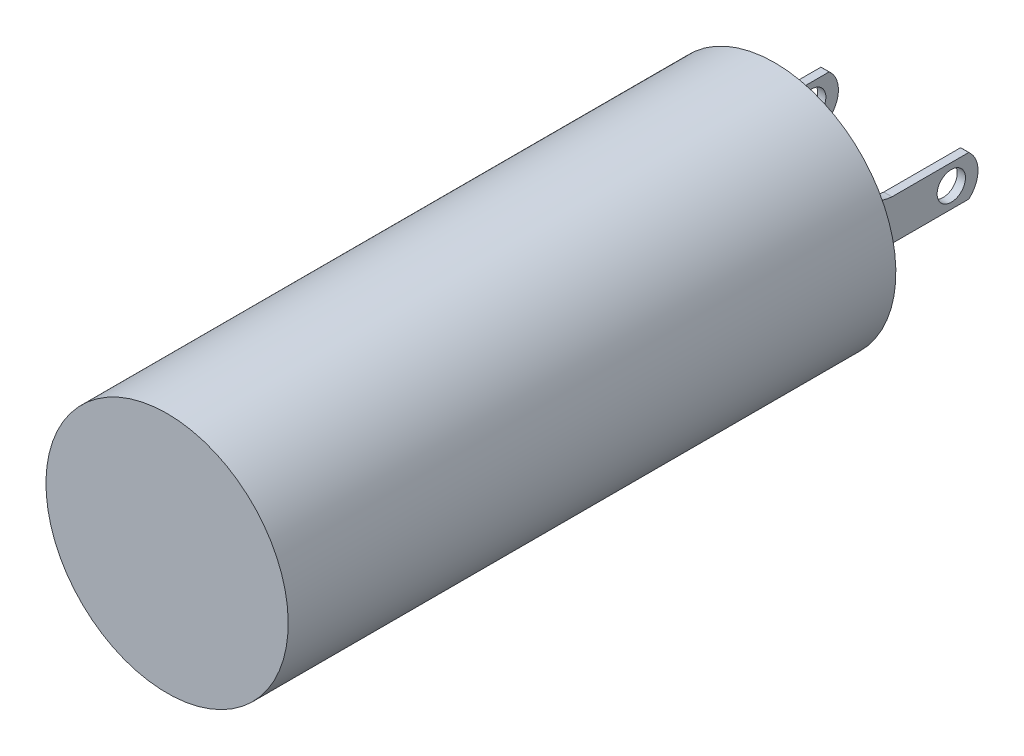
ISO-10303-21;
HEADER;
FILE_DESCRIPTION(('STEP AP214'),'2;1');
FILE_NAME('part.step','',(''),(''),'','','');
FILE_SCHEMA(('AUTOMOTIVE_DESIGN { 1 0 10303 214 1 1 1 1 }'));
ENDSEC;
DATA;
#1=APPLICATION_CONTEXT('core data for automotive mechanical design processes');
#2=APPLICATION_PROTOCOL_DEFINITION('international standard','automotive_design',2000,#1);
#3=PRODUCT_CONTEXT('',#1,'mechanical');
#4=PRODUCT('Part','Part','',(#3));
#5=PRODUCT_RELATED_PRODUCT_CATEGORY('part','',(#4));
#6=PRODUCT_DEFINITION_FORMATION('','',#4);
#7=PRODUCT_DEFINITION_CONTEXT('part definition',#1,'design');
#8=PRODUCT_DEFINITION('design','',#6,#7);
#9=PRODUCT_DEFINITION_SHAPE('','',#8);
#10=(LENGTH_UNIT() NAMED_UNIT(*) SI_UNIT(.MILLI.,.METRE.));
#11=(NAMED_UNIT(*) PLANE_ANGLE_UNIT() SI_UNIT($,.RADIAN.));
#12=(NAMED_UNIT(*) SI_UNIT($,.STERADIAN.) SOLID_ANGLE_UNIT());
#13=UNCERTAINTY_MEASURE_WITH_UNIT(LENGTH_MEASURE(1.E-05),#10,'distance_accuracy_value','');
#14=(GEOMETRIC_REPRESENTATION_CONTEXT(3) GLOBAL_UNCERTAINTY_ASSIGNED_CONTEXT((#13)) GLOBAL_UNIT_ASSIGNED_CONTEXT((#10,
#11,#12)) REPRESENTATION_CONTEXT('',''));
#15=CARTESIAN_POINT('',(0.,0.,0.));
#16=DIRECTION('',(0.,0.,1.));
#17=DIRECTION('',(1.,0.,0.));
#18=AXIS2_PLACEMENT_3D('',#15,#16,#17);
#19=CARTESIAN_POINT('',(0.,1.5875,-15.0368));
#20=DIRECTION('',(0.,0.,-1.));
#21=DIRECTION('',(0.,1.,0.));
#22=AXIS2_PLACEMENT_3D('',#19,#20,#21);
#23=PLANE('',#22);
#24=DIRECTION('',(0.,-1.,0.));
#25=VECTOR('',#24,1.);
#26=CARTESIAN_POINT('',(-1.8288,0.635,-15.0368));
#27=LINE('',#26,#25);
#28=CARTESIAN_POINT('',(-1.8288,0.635,-15.0368));
#29=VERTEX_POINT('',#28);
#30=CARTESIAN_POINT('',(-1.8288,-0.635,-15.0368));
#31=VERTEX_POINT('',#30);
#32=EDGE_CURVE('E168',#29,#31,#27,.T.);
#33=ORIENTED_EDGE('',*,*,#32,.T.);
#34=DIRECTION('',(1.,0.,0.));
#35=VECTOR('',#34,1.);
#36=CARTESIAN_POINT('',(-1.8288,-0.635,-15.0368));
#37=LINE('',#36,#35);
#38=CARTESIAN_POINT('',(-1.6256,-0.635,-15.0368));
#39=VERTEX_POINT('',#38);
#40=EDGE_CURVE('E213',#31,#39,#37,.T.);
#41=ORIENTED_EDGE('',*,*,#40,.T.);
#42=DIRECTION('',(0.,-1.,0.));
#43=VECTOR('',#42,1.);
#44=CARTESIAN_POINT('',(-1.6256,0.635,-15.0368));
#45=LINE('',#44,#43);
#46=CARTESIAN_POINT('',(-1.6256,0.635,-15.0368));
#47=VERTEX_POINT('',#46);
#48=EDGE_CURVE('E170',#47,#39,#45,.T.);
#49=ORIENTED_EDGE('',*,*,#48,.F.);
#50=DIRECTION('',(1.,0.,0.));
#51=VECTOR('',#50,1.);
#52=CARTESIAN_POINT('',(-1.8288,0.635,-15.0368));
#53=LINE('',#52,#51);
#54=EDGE_CURVE('E191',#29,#47,#53,.T.);
#55=ORIENTED_EDGE('',*,*,#54,.F.);
#56=EDGE_LOOP('',(#33,#41,#49,#55));
#57=FACE_BOUND('',#56,.T.);
#58=CARTESIAN_POINT('',(0.,0.,-15.0368));
#59=DIRECTION('',(0.,0.,-1.));
#60=DIRECTION('',(0.,1.,0.));
#61=AXIS2_PLACEMENT_3D('',#58,#59,#60);
#62=CIRCLE('',#61,1.5875);
#63=CARTESIAN_POINT('',(0.,1.5875,-15.0368));
#64=VERTEX_POINT('',#63);
#65=EDGE_CURVE('E289',#64,#64,#62,.T.);
#66=ORIENTED_EDGE('',*,*,#65,.F.);
#67=EDGE_LOOP('',(#66));
#68=FACE_BOUND('',#67,.T.);
#69=CARTESIAN_POINT('',(0.,0.,-15.0368));
#70=DIRECTION('',(0.,0.,-1.));
#71=DIRECTION('',(0.,1.,0.));
#72=AXIS2_PLACEMENT_3D('',#69,#70,#71);
#73=CIRCLE('',#72,2.9972);
#74=CARTESIAN_POINT('',(0.,2.9972,-15.0368));
#75=VERTEX_POINT('',#74);
#76=EDGE_CURVE('E44',#75,#75,#73,.T.);
#77=ORIENTED_EDGE('',*,*,#76,.T.);
#78=EDGE_LOOP('',(#77));
#79=FACE_BOUND('',#78,.T.);
#80=DIRECTION('',(0.,-1.,0.));
#81=VECTOR('',#80,1.);
#82=CARTESIAN_POINT('',(1.8288,0.635,-15.0368));
#83=LINE('',#82,#81);
#84=CARTESIAN_POINT('',(1.8288,0.635,-15.0368));
#85=VERTEX_POINT('',#84);
#86=CARTESIAN_POINT('',(1.8288,-0.635,-15.0368));
#87=VERTEX_POINT('',#86);
#88=EDGE_CURVE('E233',#85,#87,#83,.T.);
#89=ORIENTED_EDGE('',*,*,#88,.F.);
#90=DIRECTION('',(-1.,0.,0.));
#91=VECTOR('',#90,1.);
#92=CARTESIAN_POINT('',(1.8288,0.635,-15.0368));
#93=LINE('',#92,#91);
#94=CARTESIAN_POINT('',(1.6256,0.635,-15.0368));
#95=VERTEX_POINT('',#94);
#96=EDGE_CURVE('E283',#85,#95,#93,.T.);
#97=ORIENTED_EDGE('',*,*,#96,.T.);
#98=DIRECTION('',(0.,-1.,0.));
#99=VECTOR('',#98,1.);
#100=CARTESIAN_POINT('',(1.6256,0.635,-15.0368));
#101=LINE('',#100,#99);
#102=CARTESIAN_POINT('',(1.6256,-0.635,-15.0368));
#103=VERTEX_POINT('',#102);
#104=EDGE_CURVE('E250',#95,#103,#101,.T.);
#105=ORIENTED_EDGE('',*,*,#104,.T.);
#106=DIRECTION('',(-1.,0.,0.));
#107=VECTOR('',#106,1.);
#108=CARTESIAN_POINT('',(1.8288,-0.635,-15.0368));
#109=LINE('',#108,#107);
#110=EDGE_CURVE('E281',#87,#103,#109,.T.);
#111=ORIENTED_EDGE('',*,*,#110,.F.);
#112=EDGE_LOOP('',(#89,#97,#105,#111));
#113=FACE_BOUND('',#112,.T.);
#114=ADVANCED_FACE('F36',(#57,#68,#79,#113),#23,.T.);
#115=CARTESIAN_POINT('',(0.,0.,0.));
#116=DIRECTION('',(0.,0.,1.));
#117=DIRECTION('',(0.,-1.,0.));
#118=AXIS2_PLACEMENT_3D('',#115,#116,#117);
#119=PLANE('',#118);
#120=CARTESIAN_POINT('',(0.,0.,0.));
#121=DIRECTION('',(0.,0.,-1.));
#122=DIRECTION('',(0.,1.,0.));
#123=AXIS2_PLACEMENT_3D('',#120,#121,#122);
#124=CIRCLE('',#123,2.99719999999999);
#125=CARTESIAN_POINT('',(0.,2.99719999999999,0.));
#126=VERTEX_POINT('',#125);
#127=EDGE_CURVE('E11',#126,#126,#124,.T.);
#128=ORIENTED_EDGE('',*,*,#127,.F.);
#129=EDGE_LOOP('',(#128));
#130=FACE_BOUND('',#129,.T.);
#131=ADVANCED_FACE('F38',(#130),#119,.T.);
#132=CARTESIAN_POINT('',(0.,0.,-15.4178));
#133=DIRECTION('',(0.,0.,-1.));
#134=DIRECTION('',(0.,1.,0.));
#135=AXIS2_PLACEMENT_3D('',#132,#133,#134);
#136=CYLINDRICAL_SURFACE('',#135,2.99719999999999);
#137=ORIENTED_EDGE('',*,*,#127,.T.);
#138=EDGE_LOOP('',(#137));
#139=FACE_BOUND('',#138,.T.);
#140=ORIENTED_EDGE('',*,*,#76,.F.);
#141=EDGE_LOOP('',(#140));
#142=FACE_BOUND('',#141,.T.);
#143=ADVANCED_FACE('F296',(#139,#142),#136,.T.);
#144=CARTESIAN_POINT('',(0.,0.,-15.4178));
#145=DIRECTION('',(0.,0.,-1.));
#146=DIRECTION('',(0.,1.,0.));
#147=AXIS2_PLACEMENT_3D('',#144,#145,#146);
#148=CYLINDRICAL_SURFACE('',#147,1.5875);
#149=ORIENTED_EDGE('',*,*,#65,.T.);
#150=EDGE_LOOP('',(#149));
#151=FACE_BOUND('',#150,.T.);
#152=CARTESIAN_POINT('',(0.,0.,-15.4178));
#153=DIRECTION('',(0.,0.,-1.));
#154=DIRECTION('',(0.,1.,0.));
#155=AXIS2_PLACEMENT_3D('',#152,#153,#154);
#156=CIRCLE('',#155,1.5875);
#157=CARTESIAN_POINT('',(0.,1.5875,-15.4178));
#158=VERTEX_POINT('',#157);
#159=EDGE_CURVE('E286',#158,#158,#156,.T.);
#160=ORIENTED_EDGE('',*,*,#159,.F.);
#161=EDGE_LOOP('',(#160));
#162=FACE_BOUND('',#161,.T.);
#163=ADVANCED_FACE('F298',(#151,#162),#148,.T.);
#164=CARTESIAN_POINT('',(0.,0.,-15.4178));
#165=DIRECTION('',(0.,0.,-1.));
#166=DIRECTION('',(0.,1.,0.));
#167=AXIS2_PLACEMENT_3D('',#164,#165,#166);
#168=PLANE('',#167);
#169=ORIENTED_EDGE('',*,*,#159,.T.);
#170=EDGE_LOOP('',(#169));
#171=FACE_BOUND('',#170,.T.);
#172=ADVANCED_FACE('F304',(#171),#168,.T.);
#173=CARTESIAN_POINT('',(1.8288,1.54943210528019,-16.1927589575761));
#174=DIRECTION('',(1.,0.,0.));
#175=DIRECTION('',(0.,0.,-1.));
#176=AXIS2_PLACEMENT_3D('',#173,#174,#175);
#177=PLANE('',#176);
#178=DIRECTION('',(0.,0.,1.));
#179=VECTOR('',#178,1.);
#180=CARTESIAN_POINT('',(1.8288,0.635,-15.0368));
#181=LINE('',#180,#179);
#182=CARTESIAN_POINT('',(1.8288,0.635,-15.6718));
#183=VERTEX_POINT('',#182);
#184=EDGE_CURVE('E231',#183,#85,#181,.T.);
#185=ORIENTED_EDGE('',*,*,#184,.T.);
#186=ORIENTED_EDGE('',*,*,#88,.T.);
#187=DIRECTION('',(0.,0.,-1.));
#188=VECTOR('',#187,1.);
#189=CARTESIAN_POINT('',(1.8288,-0.635,-15.0368));
#190=LINE('',#189,#188);
#191=CARTESIAN_POINT('',(1.8288,-0.635,-15.6718));
#192=VERTEX_POINT('',#191);
#193=EDGE_CURVE('E59',#87,#192,#190,.T.);
#194=ORIENTED_EDGE('',*,*,#193,.T.);
#195=CARTESIAN_POINT('',(1.8288,-1.54943210528019,-16.1927589575761));
#196=DIRECTION('',(-1.,0.,0.));
#197=DIRECTION('',(0.,0.,1.));
#198=AXIS2_PLACEMENT_3D('',#195,#196,#197);
#199=CIRCLE('',#198,1.05241831542685);
#200=CARTESIAN_POINT('',(1.8288,-0.50038,-16.1086519361504));
#201=VERTEX_POINT('',#200);
#202=EDGE_CURVE('E237',#192,#201,#199,.T.);
#203=ORIENTED_EDGE('',*,*,#202,.T.);
#204=DIRECTION('',(0.,0.,-1.));
#205=VECTOR('',#204,1.);
#206=CARTESIAN_POINT('',(1.8288,-0.50038,-16.1086519361504));
#207=LINE('',#206,#205);
#208=CARTESIAN_POINT('',(1.8288,-0.50038,-18.0086));
#209=VERTEX_POINT('',#208);
#210=EDGE_CURVE('E239',#201,#209,#207,.T.);
#211=ORIENTED_EDGE('',*,*,#210,.T.);
#212=CARTESIAN_POINT('',(1.8288,0.,-17.5768));
#213=DIRECTION('',(1.,0.,0.));
#214=DIRECTION('',(0.,0.,1.));
#215=AXIS2_PLACEMENT_3D('',#212,#213,#214);
#216=CIRCLE('',#215,0.660932208626573);
#217=CARTESIAN_POINT('',(1.8288,0.50038,-18.0086));
#218=VERTEX_POINT('',#217);
#219=EDGE_CURVE('E241',#209,#218,#216,.T.);
#220=ORIENTED_EDGE('',*,*,#219,.T.);
#221=DIRECTION('',(0.,0.,1.));
#222=VECTOR('',#221,1.);
#223=CARTESIAN_POINT('',(1.8288,0.50038,-16.1086519361504));
#224=LINE('',#223,#222);
#225=CARTESIAN_POINT('',(1.8288,0.50038,-16.1086519361504));
#226=VERTEX_POINT('',#225);
#227=EDGE_CURVE('E243',#218,#226,#224,.T.);
#228=ORIENTED_EDGE('',*,*,#227,.T.);
#229=CARTESIAN_POINT('',(1.8288,1.54943210528019,-16.1927589575761));
#230=DIRECTION('',(-1.,0.,0.));
#231=DIRECTION('',(0.,0.,-1.));
#232=AXIS2_PLACEMENT_3D('',#229,#230,#231);
#233=CIRCLE('',#232,1.05241831542685);
#234=EDGE_CURVE('E245',#226,#183,#233,.T.);
#235=ORIENTED_EDGE('',*,*,#234,.T.);
#236=EDGE_LOOP('',(#185,#186,#194,#203,#211,#220,#228,#235));
#237=FACE_BOUND('',#236,.T.);
#238=CARTESIAN_POINT('',(1.8288,0.,-17.5768));
#239=DIRECTION('',(1.,0.,0.));
#240=DIRECTION('',(0.,0.,-1.));
#241=AXIS2_PLACEMENT_3D('',#238,#239,#240);
#242=CIRCLE('',#241,0.350520000000001);
#243=CARTESIAN_POINT('',(1.8288,0.,-17.92732));
#244=VERTEX_POINT('',#243);
#245=EDGE_CURVE('E225',#244,#244,#242,.T.);
#246=ORIENTED_EDGE('',*,*,#245,.F.);
#247=EDGE_LOOP('',(#246));
#248=FACE_BOUND('',#247,.T.);
#249=ADVANCED_FACE('F317',(#237,#248),#177,.T.);
#250=CARTESIAN_POINT('',(1.6256,1.54943210528019,-16.1927589575761));
#251=DIRECTION('',(1.,0.,0.));
#252=DIRECTION('',(0.,0.,-1.));
#253=AXIS2_PLACEMENT_3D('',#250,#251,#252);
#254=PLANE('',#253);
#255=DIRECTION('',(0.,0.,1.));
#256=VECTOR('',#255,1.);
#257=CARTESIAN_POINT('',(1.6256,0.635,-15.0368));
#258=LINE('',#257,#256);
#259=CARTESIAN_POINT('',(1.6256,0.635,-15.6718));
#260=VERTEX_POINT('',#259);
#261=EDGE_CURVE('E228',#260,#95,#258,.T.);
#262=ORIENTED_EDGE('',*,*,#261,.F.);
#263=CARTESIAN_POINT('',(1.6256,1.54943210528019,-16.1927589575761));
#264=DIRECTION('',(-1.,0.,0.));
#265=DIRECTION('',(0.,0.,-1.));
#266=AXIS2_PLACEMENT_3D('',#263,#264,#265);
#267=CIRCLE('',#266,1.05241831542685);
#268=CARTESIAN_POINT('',(1.6256,0.50038,-16.1086519361504));
#269=VERTEX_POINT('',#268);
#270=EDGE_CURVE('E234',#269,#260,#267,.T.);
#271=ORIENTED_EDGE('',*,*,#270,.F.);
#272=DIRECTION('',(0.,0.,1.));
#273=VECTOR('',#272,1.);
#274=CARTESIAN_POINT('',(1.6256,0.50038,-16.1086519361504));
#275=LINE('',#274,#273);
#276=CARTESIAN_POINT('',(1.6256,0.50038,-18.0086));
#277=VERTEX_POINT('',#276);
#278=EDGE_CURVE('E261',#277,#269,#275,.T.);
#279=ORIENTED_EDGE('',*,*,#278,.F.);
#280=CARTESIAN_POINT('',(1.6256,0.,-17.5768));
#281=DIRECTION('',(1.,0.,0.));
#282=DIRECTION('',(0.,0.,1.));
#283=AXIS2_PLACEMENT_3D('',#280,#281,#282);
#284=CIRCLE('',#283,0.660932208626573);
#285=CARTESIAN_POINT('',(1.6256,-0.50038,-18.0086));
#286=VERTEX_POINT('',#285);
#287=EDGE_CURVE('E259',#286,#277,#284,.T.);
#288=ORIENTED_EDGE('',*,*,#287,.F.);
#289=DIRECTION('',(0.,0.,-1.));
#290=VECTOR('',#289,1.);
#291=CARTESIAN_POINT('',(1.6256,-0.50038,-16.1086519361504));
#292=LINE('',#291,#290);
#293=CARTESIAN_POINT('',(1.6256,-0.50038,-16.1086519361504));
#294=VERTEX_POINT('',#293);
#295=EDGE_CURVE('E257',#294,#286,#292,.T.);
#296=ORIENTED_EDGE('',*,*,#295,.F.);
#297=CARTESIAN_POINT('',(1.6256,-1.54943210528019,-16.1927589575761));
#298=DIRECTION('',(-1.,0.,0.));
#299=DIRECTION('',(0.,0.,1.));
#300=AXIS2_PLACEMENT_3D('',#297,#298,#299);
#301=CIRCLE('',#300,1.05241831542685);
#302=CARTESIAN_POINT('',(1.6256,-0.635,-15.6718));
#303=VERTEX_POINT('',#302);
#304=EDGE_CURVE('E255',#303,#294,#301,.T.);
#305=ORIENTED_EDGE('',*,*,#304,.F.);
#306=DIRECTION('',(0.,0.,-1.));
#307=VECTOR('',#306,1.);
#308=CARTESIAN_POINT('',(1.6256,-0.635,-15.0368));
#309=LINE('',#308,#307);
#310=EDGE_CURVE('E253',#103,#303,#309,.T.);
#311=ORIENTED_EDGE('',*,*,#310,.F.);
#312=ORIENTED_EDGE('',*,*,#104,.F.);
#313=EDGE_LOOP('',(#262,#271,#279,#288,#296,#305,#311,#312));
#314=FACE_BOUND('',#313,.T.);
#315=CARTESIAN_POINT('',(1.6256,0.,-17.5768));
#316=DIRECTION('',(1.,0.,0.));
#317=DIRECTION('',(0.,0.,-1.));
#318=AXIS2_PLACEMENT_3D('',#315,#316,#317);
#319=CIRCLE('',#318,0.350520000000001);
#320=CARTESIAN_POINT('',(1.6256,0.,-17.92732));
#321=VERTEX_POINT('',#320);
#322=EDGE_CURVE('E157',#321,#321,#319,.T.);
#323=ORIENTED_EDGE('',*,*,#322,.T.);
#324=EDGE_LOOP('',(#323));
#325=FACE_BOUND('',#324,.T.);
#326=ADVANCED_FACE('F323',(#314,#325),#254,.F.);
#327=CARTESIAN_POINT('',(1.8288,0.635,-15.0368));
#328=DIRECTION('',(0.,-1.,0.));
#329=DIRECTION('',(0.,0.,-1.));
#330=AXIS2_PLACEMENT_3D('',#327,#328,#329);
#331=PLANE('',#330);
#332=ORIENTED_EDGE('',*,*,#261,.T.);
#333=ORIENTED_EDGE('',*,*,#96,.F.);
#334=ORIENTED_EDGE('',*,*,#184,.F.);
#335=DIRECTION('',(-1.,0.,0.));
#336=VECTOR('',#335,1.);
#337=CARTESIAN_POINT('',(1.8288,0.635,-15.6718));
#338=LINE('',#337,#336);
#339=EDGE_CURVE('E247',#183,#260,#338,.T.);
#340=ORIENTED_EDGE('',*,*,#339,.T.);
#341=EDGE_LOOP('',(#332,#333,#334,#340));
#342=FACE_BOUND('',#341,.T.);
#343=ADVANCED_FACE('F319',(#342),#331,.F.);
#344=CARTESIAN_POINT('',(1.8288,-0.635,-15.0368));
#345=DIRECTION('',(0.,1.,0.));
#346=DIRECTION('',(0.,0.,1.));
#347=AXIS2_PLACEMENT_3D('',#344,#345,#346);
#348=PLANE('',#347);
#349=ORIENTED_EDGE('',*,*,#310,.T.);
#350=DIRECTION('',(-1.,0.,0.));
#351=VECTOR('',#350,1.);
#352=CARTESIAN_POINT('',(1.8288,-0.635,-15.6718));
#353=LINE('',#352,#351);
#354=EDGE_CURVE('E278',#192,#303,#353,.T.);
#355=ORIENTED_EDGE('',*,*,#354,.F.);
#356=ORIENTED_EDGE('',*,*,#193,.F.);
#357=ORIENTED_EDGE('',*,*,#110,.T.);
#358=EDGE_LOOP('',(#349,#355,#356,#357));
#359=FACE_BOUND('',#358,.T.);
#360=ADVANCED_FACE('F322',(#359),#348,.F.);
#361=CARTESIAN_POINT('',(1.8288,-1.54943210528019,-16.1927589575761));
#362=DIRECTION('',(-1.,0.,0.));
#363=DIRECTION('',(0.,0.,1.));
#364=AXIS2_PLACEMENT_3D('',#361,#362,#363);
#365=CYLINDRICAL_SURFACE('',#364,1.05241831542685);
#366=ORIENTED_EDGE('',*,*,#304,.T.);
#367=DIRECTION('',(-1.,0.,0.));
#368=VECTOR('',#367,1.);
#369=CARTESIAN_POINT('',(1.8288,-0.50038,-16.1086519361504));
#370=LINE('',#369,#368);
#371=EDGE_CURVE('E275',#201,#294,#370,.T.);
#372=ORIENTED_EDGE('',*,*,#371,.F.);
#373=ORIENTED_EDGE('',*,*,#202,.F.);
#374=ORIENTED_EDGE('',*,*,#354,.T.);
#375=EDGE_LOOP('',(#366,#372,#373,#374));
#376=FACE_BOUND('',#375,.T.);
#377=ADVANCED_FACE('F327',(#376),#365,.F.);
#378=CARTESIAN_POINT('',(1.8288,-0.50038,-16.1086519361504));
#379=DIRECTION('',(0.,1.,0.));
#380=DIRECTION('',(0.,0.,1.));
#381=AXIS2_PLACEMENT_3D('',#378,#379,#380);
#382=PLANE('',#381);
#383=ORIENTED_EDGE('',*,*,#295,.T.);
#384=DIRECTION('',(-1.,0.,0.));
#385=VECTOR('',#384,1.);
#386=CARTESIAN_POINT('',(1.8288,-0.50038,-18.0086));
#387=LINE('',#386,#385);
#388=EDGE_CURVE('E272',#209,#286,#387,.T.);
#389=ORIENTED_EDGE('',*,*,#388,.F.);
#390=ORIENTED_EDGE('',*,*,#210,.F.);
#391=ORIENTED_EDGE('',*,*,#371,.T.);
#392=EDGE_LOOP('',(#383,#389,#390,#391));
#393=FACE_BOUND('',#392,.T.);
#394=ADVANCED_FACE('F330',(#393),#382,.F.);
#395=CARTESIAN_POINT('',(1.8288,0.,-17.5768));
#396=DIRECTION('',(-1.,0.,0.));
#397=DIRECTION('',(0.,0.,1.));
#398=AXIS2_PLACEMENT_3D('',#395,#396,#397);
#399=CYLINDRICAL_SURFACE('',#398,0.660932208626573);
#400=ORIENTED_EDGE('',*,*,#287,.T.);
#401=DIRECTION('',(-1.,0.,0.));
#402=VECTOR('',#401,1.);
#403=CARTESIAN_POINT('',(1.8288,0.50038,-18.0086));
#404=LINE('',#403,#402);
#405=EDGE_CURVE('E269',#218,#277,#404,.T.);
#406=ORIENTED_EDGE('',*,*,#405,.F.);
#407=ORIENTED_EDGE('',*,*,#219,.F.);
#408=ORIENTED_EDGE('',*,*,#388,.T.);
#409=EDGE_LOOP('',(#400,#406,#407,#408));
#410=FACE_BOUND('',#409,.T.);
#411=ADVANCED_FACE('F334',(#410),#399,.T.);
#412=CARTESIAN_POINT('',(1.8288,0.50038,-16.1086519361504));
#413=DIRECTION('',(0.,-1.,0.));
#414=DIRECTION('',(0.,0.,-1.));
#415=AXIS2_PLACEMENT_3D('',#412,#413,#414);
#416=PLANE('',#415);
#417=ORIENTED_EDGE('',*,*,#278,.T.);
#418=DIRECTION('',(-1.,0.,0.));
#419=VECTOR('',#418,1.);
#420=CARTESIAN_POINT('',(1.8288,0.50038,-16.1086519361504));
#421=LINE('',#420,#419);
#422=EDGE_CURVE('E266',#226,#269,#421,.T.);
#423=ORIENTED_EDGE('',*,*,#422,.F.);
#424=ORIENTED_EDGE('',*,*,#227,.F.);
#425=ORIENTED_EDGE('',*,*,#405,.T.);
#426=EDGE_LOOP('',(#417,#423,#424,#425));
#427=FACE_BOUND('',#426,.T.);
#428=ADVANCED_FACE('F338',(#427),#416,.F.);
#429=CARTESIAN_POINT('',(1.8288,1.54943210528019,-16.1927589575761));
#430=DIRECTION('',(-1.,0.,0.));
#431=DIRECTION('',(0.,0.,1.));
#432=AXIS2_PLACEMENT_3D('',#429,#430,#431);
#433=CYLINDRICAL_SURFACE('',#432,1.05241831542685);
#434=ORIENTED_EDGE('',*,*,#270,.T.);
#435=ORIENTED_EDGE('',*,*,#339,.F.);
#436=ORIENTED_EDGE('',*,*,#234,.F.);
#437=ORIENTED_EDGE('',*,*,#422,.T.);
#438=EDGE_LOOP('',(#434,#435,#436,#437));
#439=FACE_BOUND('',#438,.T.);
#440=ADVANCED_FACE('F342',(#439),#433,.F.);
#441=CARTESIAN_POINT('',(1.8288,0.,-17.5768));
#442=DIRECTION('',(-1.,0.,0.));
#443=DIRECTION('',(0.,0.,1.));
#444=AXIS2_PLACEMENT_3D('',#441,#442,#443);
#445=CYLINDRICAL_SURFACE('',#444,0.350520000000001);
#446=ORIENTED_EDGE('',*,*,#245,.T.);
#447=EDGE_LOOP('',(#446));
#448=FACE_BOUND('',#447,.T.);
#449=ORIENTED_EDGE('',*,*,#322,.F.);
#450=EDGE_LOOP('',(#449));
#451=FACE_BOUND('',#450,.T.);
#452=ADVANCED_FACE('F346',(#448,#451),#445,.F.);
#453=CARTESIAN_POINT('',(-1.8288,0.635,-15.0368));
#454=DIRECTION('',(0.,1.,0.));
#455=DIRECTION('',(0.,0.,1.));
#456=AXIS2_PLACEMENT_3D('',#453,#454,#455);
#457=PLANE('',#456);
#458=DIRECTION('',(0.,0.,1.));
#459=VECTOR('',#458,1.);
#460=CARTESIAN_POINT('',(-1.6256,0.635,-15.0368));
#461=LINE('',#460,#459);
#462=CARTESIAN_POINT('',(-1.6256,0.635,-15.6718));
#463=VERTEX_POINT('',#462);
#464=EDGE_CURVE('E51',#463,#47,#461,.T.);
#465=ORIENTED_EDGE('',*,*,#464,.F.);
#466=DIRECTION('',(1.,0.,0.));
#467=VECTOR('',#466,1.);
#468=CARTESIAN_POINT('',(-1.8288,0.635,-15.6718));
#469=LINE('',#468,#467);
#470=CARTESIAN_POINT('',(-1.8288,0.635,-15.6718));
#471=VERTEX_POINT('',#470);
#472=EDGE_CURVE('E149',#471,#463,#469,.T.);
#473=ORIENTED_EDGE('',*,*,#472,.F.);
#474=DIRECTION('',(0.,0.,1.));
#475=VECTOR('',#474,1.);
#476=CARTESIAN_POINT('',(-1.8288,0.635,-15.0368));
#477=LINE('',#476,#475);
#478=EDGE_CURVE('E152',#471,#29,#477,.T.);
#479=ORIENTED_EDGE('',*,*,#478,.T.);
#480=ORIENTED_EDGE('',*,*,#54,.T.);
#481=EDGE_LOOP('',(#465,#473,#479,#480));
#482=FACE_BOUND('',#481,.T.);
#483=ADVANCED_FACE('F151',(#482),#457,.T.);
#484=CARTESIAN_POINT('',(-1.8288,1.54943210528019,-16.1927589575761));
#485=DIRECTION('',(1.,0.,0.));
#486=DIRECTION('',(0.,0.,-1.));
#487=AXIS2_PLACEMENT_3D('',#484,#485,#486);
#488=CYLINDRICAL_SURFACE('',#487,1.05241831542685);
#489=CARTESIAN_POINT('',(-1.6256,1.54943210528019,-16.1927589575761));
#490=DIRECTION('',(-1.,0.,0.));
#491=DIRECTION('',(0.,0.,-1.));
#492=AXIS2_PLACEMENT_3D('',#489,#490,#491);
#493=CIRCLE('',#492,1.05241831542685);
#494=CARTESIAN_POINT('',(-1.6256,0.50038,-16.1086519361504));
#495=VERTEX_POINT('',#494);
#496=EDGE_CURVE('E193',#495,#463,#493,.T.);
#497=ORIENTED_EDGE('',*,*,#496,.F.);
#498=DIRECTION('',(1.,0.,0.));
#499=VECTOR('',#498,1.);
#500=CARTESIAN_POINT('',(-1.8288,0.50038,-16.1086519361504));
#501=LINE('',#500,#499);
#502=CARTESIAN_POINT('',(-1.8288,0.50038,-16.1086519361504));
#503=VERTEX_POINT('',#502);
#504=EDGE_CURVE('E158',#503,#495,#501,.T.);
#505=ORIENTED_EDGE('',*,*,#504,.F.);
#506=CARTESIAN_POINT('',(-1.8288,1.54943210528019,-16.1927589575761));
#507=DIRECTION('',(-1.,0.,0.));
#508=DIRECTION('',(0.,0.,-1.));
#509=AXIS2_PLACEMENT_3D('',#506,#507,#508);
#510=CIRCLE('',#509,1.05241831542685);
#511=EDGE_CURVE('E164',#503,#471,#510,.T.);
#512=ORIENTED_EDGE('',*,*,#511,.T.);
#513=ORIENTED_EDGE('',*,*,#472,.T.);
#514=EDGE_LOOP('',(#497,#505,#512,#513));
#515=FACE_BOUND('',#514,.T.);
#516=ADVANCED_FACE('F172',(#515),#488,.F.);
#517=CARTESIAN_POINT('',(-1.8288,0.50038,-16.1086519361504));
#518=DIRECTION('',(0.,1.,0.));
#519=DIRECTION('',(0.,0.,1.));
#520=AXIS2_PLACEMENT_3D('',#517,#518,#519);
#521=PLANE('',#520);
#522=DIRECTION('',(0.,0.,1.));
#523=VECTOR('',#522,1.);
#524=CARTESIAN_POINT('',(-1.6256,0.50038,-16.1086519361504));
#525=LINE('',#524,#523);
#526=CARTESIAN_POINT('',(-1.6256,0.50038,-18.0086));
#527=VERTEX_POINT('',#526);
#528=EDGE_CURVE('E196',#527,#495,#525,.T.);
#529=ORIENTED_EDGE('',*,*,#528,.F.);
#530=DIRECTION('',(1.,0.,0.));
#531=VECTOR('',#530,1.);
#532=CARTESIAN_POINT('',(-1.8288,0.50038,-18.0086));
#533=LINE('',#532,#531);
#534=CARTESIAN_POINT('',(-1.8288,0.50038,-18.0086));
#535=VERTEX_POINT('',#534);
#536=EDGE_CURVE('E222',#535,#527,#533,.T.);
#537=ORIENTED_EDGE('',*,*,#536,.F.);
#538=DIRECTION('',(0.,0.,1.));
#539=VECTOR('',#538,1.);
#540=CARTESIAN_POINT('',(-1.8288,0.50038,-16.1086519361504));
#541=LINE('',#540,#539);
#542=EDGE_CURVE('E173',#535,#503,#541,.T.);
#543=ORIENTED_EDGE('',*,*,#542,.T.);
#544=ORIENTED_EDGE('',*,*,#504,.T.);
#545=EDGE_LOOP('',(#529,#537,#543,#544));
#546=FACE_BOUND('',#545,.T.);
#547=ADVANCED_FACE('F361',(#546),#521,.T.);
#548=CARTESIAN_POINT('',(-1.8288,0.,-17.5768));
#549=DIRECTION('',(1.,0.,0.));
#550=DIRECTION('',(0.,0.,-1.));
#551=AXIS2_PLACEMENT_3D('',#548,#549,#550);
#552=CYLINDRICAL_SURFACE('',#551,0.660932208626573);
#553=CARTESIAN_POINT('',(-1.6256,0.,-17.5768));
#554=DIRECTION('',(1.,0.,0.));
#555=DIRECTION('',(0.,0.,1.));
#556=AXIS2_PLACEMENT_3D('',#553,#554,#555);
#557=CIRCLE('',#556,0.660932208626573);
#558=CARTESIAN_POINT('',(-1.6256,-0.50038,-18.0086));
#559=VERTEX_POINT('',#558);
#560=EDGE_CURVE('E199',#559,#527,#557,.T.);
#561=ORIENTED_EDGE('',*,*,#560,.F.);
#562=DIRECTION('',(1.,0.,0.));
#563=VECTOR('',#562,1.);
#564=CARTESIAN_POINT('',(-1.8288,-0.50038,-18.0086));
#565=LINE('',#564,#563);
#566=CARTESIAN_POINT('',(-1.8288,-0.50038,-18.0086));
#567=VERTEX_POINT('',#566);
#568=EDGE_CURVE('E220',#567,#559,#565,.T.);
#569=ORIENTED_EDGE('',*,*,#568,.F.);
#570=CARTESIAN_POINT('',(-1.8288,0.,-17.5768));
#571=DIRECTION('',(1.,0.,0.));
#572=DIRECTION('',(0.,0.,1.));
#573=AXIS2_PLACEMENT_3D('',#570,#571,#572);
#574=CIRCLE('',#573,0.660932208626573);
#575=EDGE_CURVE('E175',#567,#535,#574,.T.);
#576=ORIENTED_EDGE('',*,*,#575,.T.);
#577=ORIENTED_EDGE('',*,*,#536,.T.);
#578=EDGE_LOOP('',(#561,#569,#576,#577));
#579=FACE_BOUND('',#578,.T.);
#580=ADVANCED_FACE('F364',(#579),#552,.T.);
#581=CARTESIAN_POINT('',(-1.8288,-0.50038,-16.1086519361504));
#582=DIRECTION('',(0.,-1.,0.));
#583=DIRECTION('',(0.,0.,-1.));
#584=AXIS2_PLACEMENT_3D('',#581,#582,#583);
#585=PLANE('',#584);
#586=DIRECTION('',(0.,0.,-1.));
#587=VECTOR('',#586,1.);
#588=CARTESIAN_POINT('',(-1.6256,-0.50038,-16.1086519361504));
#589=LINE('',#588,#587);
#590=CARTESIAN_POINT('',(-1.6256,-0.50038,-16.1086519361504));
#591=VERTEX_POINT('',#590);
#592=EDGE_CURVE('E202',#591,#559,#589,.T.);
#593=ORIENTED_EDGE('',*,*,#592,.F.);
#594=DIRECTION('',(1.,0.,0.));
#595=VECTOR('',#594,1.);
#596=CARTESIAN_POINT('',(-1.8288,-0.50038,-16.1086519361504));
#597=LINE('',#596,#595);
#598=CARTESIAN_POINT('',(-1.8288,-0.50038,-16.1086519361504));
#599=VERTEX_POINT('',#598);
#600=EDGE_CURVE('E218',#599,#591,#597,.T.);
#601=ORIENTED_EDGE('',*,*,#600,.F.);
#602=DIRECTION('',(0.,0.,-1.));
#603=VECTOR('',#602,1.);
#604=CARTESIAN_POINT('',(-1.8288,-0.50038,-16.1086519361504));
#605=LINE('',#604,#603);
#606=EDGE_CURVE('E181',#599,#567,#605,.T.);
#607=ORIENTED_EDGE('',*,*,#606,.T.);
#608=ORIENTED_EDGE('',*,*,#568,.T.);
#609=EDGE_LOOP('',(#593,#601,#607,#608));
#610=FACE_BOUND('',#609,.T.);
#611=ADVANCED_FACE('F368',(#610),#585,.T.);
#612=CARTESIAN_POINT('',(-1.8288,-1.54943210528019,-16.1927589575761));
#613=DIRECTION('',(1.,0.,0.));
#614=DIRECTION('',(0.,0.,-1.));
#615=AXIS2_PLACEMENT_3D('',#612,#613,#614);
#616=CYLINDRICAL_SURFACE('',#615,1.05241831542685);
#617=CARTESIAN_POINT('',(-1.6256,-1.54943210528019,-16.1927589575761));
#618=DIRECTION('',(-1.,0.,0.));
#619=DIRECTION('',(0.,0.,1.));
#620=AXIS2_PLACEMENT_3D('',#617,#618,#619);
#621=CIRCLE('',#620,1.05241831542685);
#622=CARTESIAN_POINT('',(-1.6256,-0.635,-15.6718));
#623=VERTEX_POINT('',#622);
#624=EDGE_CURVE('E205',#623,#591,#621,.T.);
#625=ORIENTED_EDGE('',*,*,#624,.F.);
#626=DIRECTION('',(1.,0.,0.));
#627=VECTOR('',#626,1.);
#628=CARTESIAN_POINT('',(-1.8288,-0.635,-15.6718));
#629=LINE('',#628,#627);
#630=CARTESIAN_POINT('',(-1.8288,-0.635,-15.6718));
#631=VERTEX_POINT('',#630);
#632=EDGE_CURVE('E216',#631,#623,#629,.T.);
#633=ORIENTED_EDGE('',*,*,#632,.F.);
#634=CARTESIAN_POINT('',(-1.8288,-1.54943210528019,-16.1927589575761));
#635=DIRECTION('',(-1.,0.,0.));
#636=DIRECTION('',(0.,0.,1.));
#637=AXIS2_PLACEMENT_3D('',#634,#635,#636);
#638=CIRCLE('',#637,1.05241831542685);
#639=EDGE_CURVE('E184',#631,#599,#638,.T.);
#640=ORIENTED_EDGE('',*,*,#639,.T.);
#641=ORIENTED_EDGE('',*,*,#600,.T.);
#642=EDGE_LOOP('',(#625,#633,#640,#641));
#643=FACE_BOUND('',#642,.T.);
#644=ADVANCED_FACE('F372',(#643),#616,.F.);
#645=CARTESIAN_POINT('',(-1.8288,-0.635,-15.0368));
#646=DIRECTION('',(0.,-1.,0.));
#647=DIRECTION('',(0.,0.,-1.));
#648=AXIS2_PLACEMENT_3D('',#645,#646,#647);
#649=PLANE('',#648);
#650=DIRECTION('',(0.,0.,-1.));
#651=VECTOR('',#650,1.);
#652=CARTESIAN_POINT('',(-1.6256,-0.635,-15.0368));
#653=LINE('',#652,#651);
#654=EDGE_CURVE('E208',#39,#623,#653,.T.);
#655=ORIENTED_EDGE('',*,*,#654,.F.);
#656=ORIENTED_EDGE('',*,*,#40,.F.);
#657=DIRECTION('',(0.,0.,-1.));
#658=VECTOR('',#657,1.);
#659=CARTESIAN_POINT('',(-1.8288,-0.635,-15.0368));
#660=LINE('',#659,#658);
#661=EDGE_CURVE('E187',#31,#631,#660,.T.);
#662=ORIENTED_EDGE('',*,*,#661,.T.);
#663=ORIENTED_EDGE('',*,*,#632,.T.);
#664=EDGE_LOOP('',(#655,#656,#662,#663));
#665=FACE_BOUND('',#664,.T.);
#666=ADVANCED_FACE('F376',(#665),#649,.T.);
#667=CARTESIAN_POINT('',(-1.8288,1.54943210528019,-16.1927589575761));
#668=DIRECTION('',(-1.,0.,0.));
#669=DIRECTION('',(0.,0.,-1.));
#670=AXIS2_PLACEMENT_3D('',#667,#668,#669);
#671=PLANE('',#670);
#672=CARTESIAN_POINT('',(-1.8288,0.,-17.5768));
#673=DIRECTION('',(1.,0.,0.));
#674=DIRECTION('',(0.,0.,-1.));
#675=AXIS2_PLACEMENT_3D('',#672,#673,#674);
#676=CIRCLE('',#675,0.350520000000001);
#677=CARTESIAN_POINT('',(-1.8288,0.,-17.92732));
#678=VERTEX_POINT('',#677);
#679=EDGE_CURVE('E194',#678,#678,#676,.T.);
#680=ORIENTED_EDGE('',*,*,#679,.T.);
#681=EDGE_LOOP('',(#680));
#682=FACE_BOUND('',#681,.T.);
#683=ORIENTED_EDGE('',*,*,#478,.F.);
#684=ORIENTED_EDGE('',*,*,#511,.F.);
#685=ORIENTED_EDGE('',*,*,#542,.F.);
#686=ORIENTED_EDGE('',*,*,#575,.F.);
#687=ORIENTED_EDGE('',*,*,#606,.F.);
#688=ORIENTED_EDGE('',*,*,#639,.F.);
#689=ORIENTED_EDGE('',*,*,#661,.F.);
#690=ORIENTED_EDGE('',*,*,#32,.F.);
#691=EDGE_LOOP('',(#683,#684,#685,#686,#687,#688,#689,#690));
#692=FACE_BOUND('',#691,.T.);
#693=ADVANCED_FACE('F162',(#682,#692),#671,.T.);
#694=CARTESIAN_POINT('',(-1.6256,1.54943210528019,-16.1927589575761));
#695=DIRECTION('',(-1.,0.,0.));
#696=DIRECTION('',(0.,0.,-1.));
#697=AXIS2_PLACEMENT_3D('',#694,#695,#696);
#698=PLANE('',#697);
#699=CARTESIAN_POINT('',(-1.6256,0.,-17.5768));
#700=DIRECTION('',(1.,0.,0.));
#701=DIRECTION('',(0.,0.,-1.));
#702=AXIS2_PLACEMENT_3D('',#699,#700,#701);
#703=CIRCLE('',#702,0.350520000000001);
#704=CARTESIAN_POINT('',(-1.6256,0.,-17.92732));
#705=VERTEX_POINT('',#704);
#706=EDGE_CURVE('E398',#705,#705,#703,.T.);
#707=ORIENTED_EDGE('',*,*,#706,.F.);
#708=EDGE_LOOP('',(#707));
#709=FACE_BOUND('',#708,.T.);
#710=ORIENTED_EDGE('',*,*,#464,.T.);
#711=ORIENTED_EDGE('',*,*,#48,.T.);
#712=ORIENTED_EDGE('',*,*,#654,.T.);
#713=ORIENTED_EDGE('',*,*,#624,.T.);
#714=ORIENTED_EDGE('',*,*,#592,.T.);
#715=ORIENTED_EDGE('',*,*,#560,.T.);
#716=ORIENTED_EDGE('',*,*,#528,.T.);
#717=ORIENTED_EDGE('',*,*,#496,.T.);
#718=EDGE_LOOP('',(#710,#711,#712,#713,#714,#715,#716,#717));
#719=FACE_BOUND('',#718,.T.);
#720=ADVANCED_FACE('F381',(#709,#719),#698,.F.);
#721=CARTESIAN_POINT('',(-1.8288,0.,-17.5768));
#722=DIRECTION('',(1.,0.,0.));
#723=DIRECTION('',(0.,0.,-1.));
#724=AXIS2_PLACEMENT_3D('',#721,#722,#723);
#725=CYLINDRICAL_SURFACE('',#724,0.350520000000001);
#726=ORIENTED_EDGE('',*,*,#679,.F.);
#727=EDGE_LOOP('',(#726));
#728=FACE_BOUND('',#727,.T.);
#729=ORIENTED_EDGE('',*,*,#706,.T.);
#730=EDGE_LOOP('',(#729));
#731=FACE_BOUND('',#730,.T.);
#732=ADVANCED_FACE('F384',(#728,#731),#725,.F.);
#733=CLOSED_SHELL('',(#114,#131,#143,#163,#172,#249,#326,#343,#360,#377,#394,#411,#428,#440,
#452,#483,#516,#547,#580,#611,#644,#666,#693,#720,#732));
#734=MANIFOLD_SOLID_BREP('B2',#733);
#735=ADVANCED_BREP_SHAPE_REPRESENTATION('',(#18,#734),#14);
#736=SHAPE_DEFINITION_REPRESENTATION(#9,#735);
ENDSEC;
END-ISO-10303-21;
